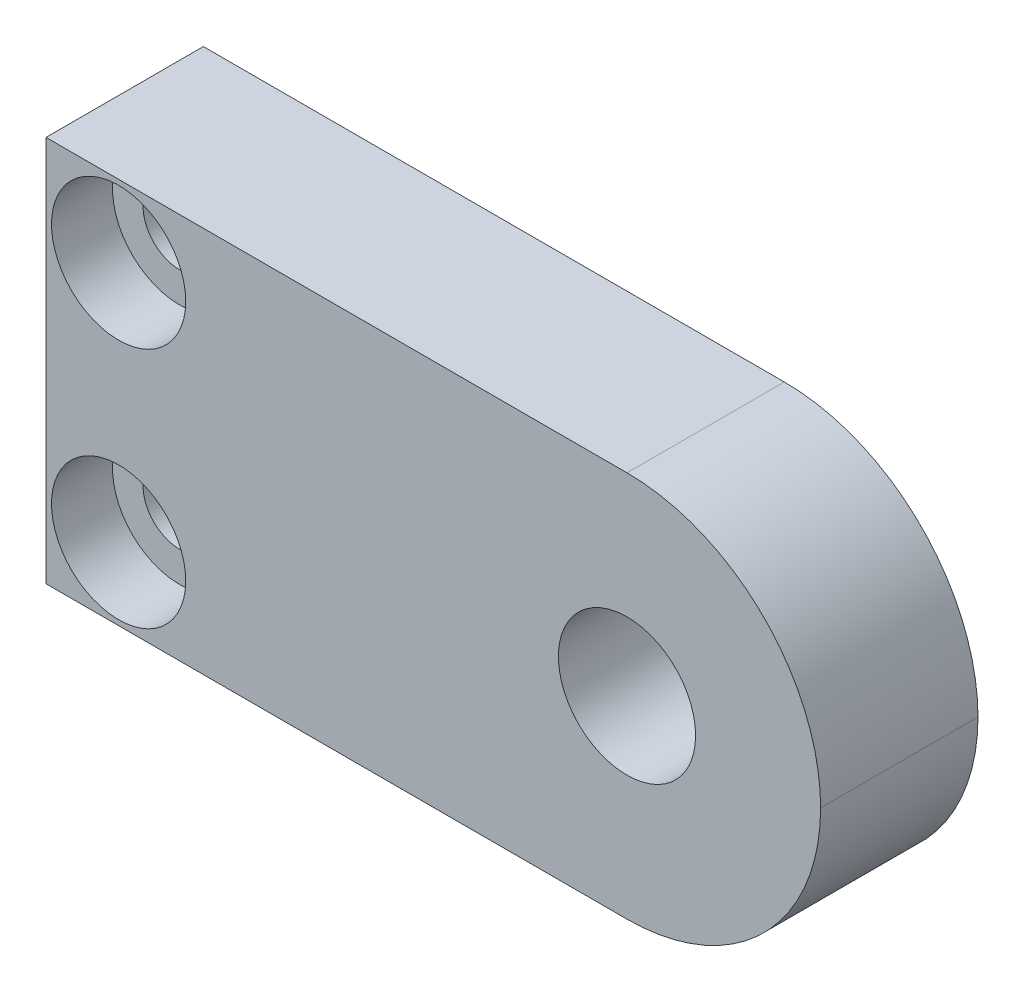
ISO-10303-21;
HEADER;
FILE_DESCRIPTION(('STEP AP214'),'2;1');
FILE_NAME('part.step','',(''),(''),'','','');
FILE_SCHEMA(('AUTOMOTIVE_DESIGN { 1 0 10303 214 1 1 1 1 }'));
ENDSEC;
DATA;
#1=APPLICATION_CONTEXT('core data for automotive mechanical design processes');
#2=APPLICATION_PROTOCOL_DEFINITION('international standard','automotive_design',2000,#1);
#3=PRODUCT_CONTEXT('',#1,'mechanical');
#4=PRODUCT('Part','Part','',(#3));
#5=PRODUCT_RELATED_PRODUCT_CATEGORY('part','',(#4));
#6=PRODUCT_DEFINITION_FORMATION('','',#4);
#7=PRODUCT_DEFINITION_CONTEXT('part definition',#1,'design');
#8=PRODUCT_DEFINITION('design','',#6,#7);
#9=PRODUCT_DEFINITION_SHAPE('','',#8);
#10=(LENGTH_UNIT() NAMED_UNIT(*) SI_UNIT(.MILLI.,.METRE.));
#11=(NAMED_UNIT(*) PLANE_ANGLE_UNIT() SI_UNIT($,.RADIAN.));
#12=(NAMED_UNIT(*) SI_UNIT($,.STERADIAN.) SOLID_ANGLE_UNIT());
#13=UNCERTAINTY_MEASURE_WITH_UNIT(LENGTH_MEASURE(1.E-05),#10,'distance_accuracy_value','');
#14=(GEOMETRIC_REPRESENTATION_CONTEXT(3) GLOBAL_UNCERTAINTY_ASSIGNED_CONTEXT((#13)) GLOBAL_UNIT_ASSIGNED_CONTEXT((#10,
#11,#12)) REPRESENTATION_CONTEXT('',''));
#15=CARTESIAN_POINT('',(0.,0.,0.));
#16=DIRECTION('',(0.,0.,1.));
#17=DIRECTION('',(1.,0.,0.));
#18=AXIS2_PLACEMENT_3D('',#15,#16,#17);
#19=CARTESIAN_POINT('',(0.,6.3373,5.159375));
#20=DIRECTION('',(1.,0.,0.));
#21=DIRECTION('',(0.,0.,-1.));
#22=AXIS2_PLACEMENT_3D('',#19,#20,#21);
#23=PLANE('',#22);
#24=DIRECTION('',(0.,-1.,0.));
#25=VECTOR('',#24,1.);
#26=CARTESIAN_POINT('',(0.,6.3373,0.));
#27=LINE('',#26,#25);
#28=CARTESIAN_POINT('',(0.,6.3373,0.));
#29=VERTEX_POINT('',#28);
#30=CARTESIAN_POINT('',(0.,-6.3373,0.));
#31=VERTEX_POINT('',#30);
#32=EDGE_CURVE('E105',#29,#31,#27,.T.);
#33=ORIENTED_EDGE('',*,*,#32,.T.);
#34=DIRECTION('',(0.,0.,-1.));
#35=VECTOR('',#34,1.);
#36=CARTESIAN_POINT('',(0.,-6.3373,5.159375));
#37=LINE('',#36,#35);
#38=CARTESIAN_POINT('',(0.,-6.3373,5.159375));
#39=VERTEX_POINT('',#38);
#40=EDGE_CURVE('E88',#39,#31,#37,.T.);
#41=ORIENTED_EDGE('',*,*,#40,.F.);
#42=DIRECTION('',(0.,-1.,0.));
#43=VECTOR('',#42,1.);
#44=CARTESIAN_POINT('',(0.,6.3373,5.159375));
#45=LINE('',#44,#43);
#46=CARTESIAN_POINT('',(0.,6.3373,5.159375));
#47=VERTEX_POINT('',#46);
#48=EDGE_CURVE('E94',#47,#39,#45,.T.);
#49=ORIENTED_EDGE('',*,*,#48,.F.);
#50=DIRECTION('',(0.,0.,-1.));
#51=VECTOR('',#50,1.);
#52=CARTESIAN_POINT('',(0.,6.3373,5.159375));
#53=LINE('',#52,#51);
#54=EDGE_CURVE('E108',#47,#29,#53,.T.);
#55=ORIENTED_EDGE('',*,*,#54,.T.);
#56=EDGE_LOOP('',(#33,#41,#49,#55));
#57=FACE_BOUND('',#56,.T.);
#58=ADVANCED_FACE('F38',(#57),#23,.F.);
#59=CARTESIAN_POINT('',(0.,-6.3373,5.159375));
#60=DIRECTION('',(0.,1.,0.));
#61=DIRECTION('',(0.,0.,1.));
#62=AXIS2_PLACEMENT_3D('',#59,#60,#61);
#63=PLANE('',#62);
#64=DIRECTION('',(1.,0.,0.));
#65=VECTOR('',#64,1.);
#66=CARTESIAN_POINT('',(0.,-6.3373,0.));
#67=LINE('',#66,#65);
#68=CARTESIAN_POINT('',(19.05,-6.3373,0.));
#69=VERTEX_POINT('',#68);
#70=EDGE_CURVE('E134',#31,#69,#67,.T.);
#71=ORIENTED_EDGE('',*,*,#70,.T.);
#72=DIRECTION('',(0.,0.,-1.));
#73=VECTOR('',#72,1.);
#74=CARTESIAN_POINT('',(19.05,-6.3373,5.15937499999997));
#75=LINE('',#74,#73);
#76=CARTESIAN_POINT('',(19.05,-6.3373,5.15937499999997));
#77=VERTEX_POINT('',#76);
#78=EDGE_CURVE('E91',#69,#77,#75,.F.);
#79=ORIENTED_EDGE('',*,*,#78,.T.);
#80=DIRECTION('',(1.,0.,0.));
#81=VECTOR('',#80,1.);
#82=CARTESIAN_POINT('',(0.,-6.3373,5.159375));
#83=LINE('',#82,#81);
#84=EDGE_CURVE('E83',#39,#77,#83,.T.);
#85=ORIENTED_EDGE('',*,*,#84,.F.);
#86=ORIENTED_EDGE('',*,*,#40,.T.);
#87=EDGE_LOOP('',(#71,#79,#85,#86));
#88=FACE_BOUND('',#87,.T.);
#89=ADVANCED_FACE('F86',(#88),#63,.F.);
#90=CARTESIAN_POINT('',(0.,6.3373,5.159375));
#91=DIRECTION('',(0.,-1.,0.));
#92=DIRECTION('',(0.,0.,-1.));
#93=AXIS2_PLACEMENT_3D('',#90,#91,#92);
#94=PLANE('',#93);
#95=DIRECTION('',(-1.,0.,0.));
#96=VECTOR('',#95,1.);
#97=CARTESIAN_POINT('',(0.,6.3373,5.159375));
#98=LINE('',#97,#96);
#99=CARTESIAN_POINT('',(19.05,6.3373,5.15937499999997));
#100=VERTEX_POINT('',#99);
#101=EDGE_CURVE('E93',#100,#47,#98,.T.);
#102=ORIENTED_EDGE('',*,*,#101,.F.);
#103=DIRECTION('',(0.,0.,-1.));
#104=VECTOR('',#103,1.);
#105=CARTESIAN_POINT('',(19.05,6.3373,5.15937499999997));
#106=LINE('',#105,#104);
#107=CARTESIAN_POINT('',(19.05,6.3373,0.));
#108=VERTEX_POINT('',#107);
#109=EDGE_CURVE('E11',#100,#108,#106,.T.);
#110=ORIENTED_EDGE('',*,*,#109,.T.);
#111=DIRECTION('',(-1.,0.,0.));
#112=VECTOR('',#111,1.);
#113=CARTESIAN_POINT('',(0.,6.3373,0.));
#114=LINE('',#113,#112);
#115=EDGE_CURVE('E102',#108,#29,#114,.T.);
#116=ORIENTED_EDGE('',*,*,#115,.T.);
#117=ORIENTED_EDGE('',*,*,#54,.F.);
#118=EDGE_LOOP('',(#102,#110,#116,#117));
#119=FACE_BOUND('',#118,.T.);
#120=ADVANCED_FACE('F174',(#119),#94,.F.);
#121=CARTESIAN_POINT('',(0.,0.,5.159375));
#122=DIRECTION('',(0.,0.,1.));
#123=DIRECTION('',(1.,0.,0.));
#124=AXIS2_PLACEMENT_3D('',#121,#122,#123);
#125=PLANE('',#124);
#126=CARTESIAN_POINT('',(2.38125000000006,3.96875,5.159375));
#127=DIRECTION('',(0.,0.,1.));
#128=DIRECTION('',(1.,0.,0.));
#129=AXIS2_PLACEMENT_3D('',#126,#127,#128);
#130=CIRCLE('',#129,2.2);
#131=CARTESIAN_POINT('',(4.58125000000006,3.96875,5.159375));
#132=VERTEX_POINT('',#131);
#133=EDGE_CURVE('E230',#132,#132,#130,.T.);
#134=ORIENTED_EDGE('',*,*,#133,.F.);
#135=EDGE_LOOP('',(#134));
#136=FACE_BOUND('',#135,.T.);
#137=CARTESIAN_POINT('',(2.38125000000006,-3.96875,5.159375));
#138=DIRECTION('',(0.,0.,1.));
#139=DIRECTION('',(1.,0.,0.));
#140=AXIS2_PLACEMENT_3D('',#137,#138,#139);
#141=CIRCLE('',#140,2.2);
#142=CARTESIAN_POINT('',(4.58125000000006,-3.96875,5.159375));
#143=VERTEX_POINT('',#142);
#144=EDGE_CURVE('E245',#143,#143,#141,.T.);
#145=ORIENTED_EDGE('',*,*,#144,.F.);
#146=EDGE_LOOP('',(#145));
#147=FACE_BOUND('',#146,.T.);
#148=CARTESIAN_POINT('',(19.05,0.,5.15937499999997));
#149=DIRECTION('',(0.,0.,1.));
#150=DIRECTION('',(1.,0.,0.));
#151=AXIS2_PLACEMENT_3D('',#148,#149,#150);
#152=CIRCLE('',#151,2.24917);
#153=CARTESIAN_POINT('',(21.29917,0.,5.15937499999997));
#154=VERTEX_POINT('',#153);
#155=EDGE_CURVE('E145',#154,#154,#152,.T.);
#156=ORIENTED_EDGE('',*,*,#155,.F.);
#157=EDGE_LOOP('',(#156));
#158=FACE_BOUND('',#157,.T.);
#159=ORIENTED_EDGE('',*,*,#84,.T.);
#160=CARTESIAN_POINT('',(19.05,0.0126999999999974,5.15937499999997));
#161=DIRECTION('',(0.,0.,1.));
#162=DIRECTION('',(1.,0.,0.));
#163=AXIS2_PLACEMENT_3D('',#160,#161,#162);
#164=CIRCLE('',#163,6.35);
#165=CARTESIAN_POINT('',(25.3999872999872,0.,5.159375));
#166=VERTEX_POINT('',#165);
#167=EDGE_CURVE('E48',#77,#166,#164,.T.);
#168=ORIENTED_EDGE('',*,*,#167,.T.);
#169=CARTESIAN_POINT('',(19.05,-0.0126999999999974,5.15937499999997));
#170=DIRECTION('',(0.,0.,1.));
#171=DIRECTION('',(1.,0.,0.));
#172=AXIS2_PLACEMENT_3D('',#169,#170,#171);
#173=CIRCLE('',#172,6.35);
#174=EDGE_CURVE('E58',#166,#100,#173,.T.);
#175=ORIENTED_EDGE('',*,*,#174,.T.);
#176=ORIENTED_EDGE('',*,*,#101,.T.);
#177=ORIENTED_EDGE('',*,*,#48,.T.);
#178=EDGE_LOOP('',(#159,#168,#175,#176,#177));
#179=FACE_BOUND('',#178,.T.);
#180=ADVANCED_FACE('F97',(#136,#147,#158,#179),#125,.T.);
#181=CARTESIAN_POINT('',(0.,0.,0.));
#182=DIRECTION('',(0.,0.,1.));
#183=DIRECTION('',(1.,0.,0.));
#184=AXIS2_PLACEMENT_3D('',#181,#182,#183);
#185=PLANE('',#184);
#186=CARTESIAN_POINT('',(2.38125,3.96875,0.));
#187=DIRECTION('',(0.,0.,1.));
#188=DIRECTION('',(1.,0.,0.));
#189=AXIS2_PLACEMENT_3D('',#186,#187,#188);
#190=CIRCLE('',#189,1.2);
#191=CARTESIAN_POINT('',(3.58125,3.96875,0.));
#192=VERTEX_POINT('',#191);
#193=EDGE_CURVE('E241',#192,#192,#190,.T.);
#194=ORIENTED_EDGE('',*,*,#193,.T.);
#195=EDGE_LOOP('',(#194));
#196=FACE_BOUND('',#195,.T.);
#197=CARTESIAN_POINT('',(2.38125,-3.96875,0.));
#198=DIRECTION('',(0.,0.,1.));
#199=DIRECTION('',(1.,0.,0.));
#200=AXIS2_PLACEMENT_3D('',#197,#198,#199);
#201=CIRCLE('',#200,1.2);
#202=CARTESIAN_POINT('',(3.58125,-3.96875,0.));
#203=VERTEX_POINT('',#202);
#204=EDGE_CURVE('E146',#203,#203,#201,.T.);
#205=ORIENTED_EDGE('',*,*,#204,.T.);
#206=EDGE_LOOP('',(#205));
#207=FACE_BOUND('',#206,.T.);
#208=CARTESIAN_POINT('',(19.05,0.,0.));
#209=DIRECTION('',(0.,0.,1.));
#210=DIRECTION('',(1.,0.,0.));
#211=AXIS2_PLACEMENT_3D('',#208,#209,#210);
#212=CIRCLE('',#211,2.24917);
#213=CARTESIAN_POINT('',(21.29917,0.,0.));
#214=VERTEX_POINT('',#213);
#215=EDGE_CURVE('E151',#214,#214,#212,.T.);
#216=ORIENTED_EDGE('',*,*,#215,.T.);
#217=EDGE_LOOP('',(#216));
#218=FACE_BOUND('',#217,.T.);
#219=CARTESIAN_POINT('',(19.05,-0.0126999999999974,0.));
#220=DIRECTION('',(0.,0.,1.));
#221=DIRECTION('',(1.,0.,0.));
#222=AXIS2_PLACEMENT_3D('',#219,#220,#221);
#223=CIRCLE('',#222,6.35);
#224=CARTESIAN_POINT('',(25.3999872999873,0.,0.));
#225=VERTEX_POINT('',#224);
#226=EDGE_CURVE('E107',#108,#225,#223,.F.);
#227=ORIENTED_EDGE('',*,*,#226,.T.);
#228=CARTESIAN_POINT('',(19.05,0.0126999999999974,0.));
#229=DIRECTION('',(0.,0.,1.));
#230=DIRECTION('',(1.,0.,0.));
#231=AXIS2_PLACEMENT_3D('',#228,#229,#230);
#232=CIRCLE('',#231,6.35);
#233=EDGE_CURVE('E113',#225,#69,#232,.F.);
#234=ORIENTED_EDGE('',*,*,#233,.T.);
#235=ORIENTED_EDGE('',*,*,#70,.F.);
#236=ORIENTED_EDGE('',*,*,#32,.F.);
#237=ORIENTED_EDGE('',*,*,#115,.F.);
#238=EDGE_LOOP('',(#227,#234,#235,#236,#237));
#239=FACE_BOUND('',#238,.T.);
#240=ADVANCED_FACE('F133',(#196,#207,#218,#239),#185,.F.);
#241=CARTESIAN_POINT('',(19.05,0.,0.));
#242=DIRECTION('',(0.,0.,1.));
#243=DIRECTION('',(1.,0.,0.));
#244=AXIS2_PLACEMENT_3D('',#241,#242,#243);
#245=CYLINDRICAL_SURFACE('',#244,2.24917);
#246=ORIENTED_EDGE('',*,*,#215,.F.);
#247=EDGE_LOOP('',(#246));
#248=FACE_BOUND('',#247,.T.);
#249=ORIENTED_EDGE('',*,*,#155,.T.);
#250=EDGE_LOOP('',(#249));
#251=FACE_BOUND('',#250,.T.);
#252=ADVANCED_FACE('F177',(#248,#251),#245,.F.);
#253=CARTESIAN_POINT('',(19.05,-0.0126999999999974,5.15937499999997));
#254=DIRECTION('',(0.,0.,-1.));
#255=DIRECTION('',(-1.,0.,0.));
#256=AXIS2_PLACEMENT_3D('',#253,#254,#255);
#257=CYLINDRICAL_SURFACE('',#256,6.35);
#258=ORIENTED_EDGE('',*,*,#109,.F.);
#259=ORIENTED_EDGE('',*,*,#174,.F.);
#260=DIRECTION('',(0.,0.,-1.));
#261=VECTOR('',#260,1.);
#262=CARTESIAN_POINT('',(25.3999872999874,0.,2.5796875));
#263=LINE('',#262,#261);
#264=EDGE_CURVE('E42',#225,#166,#263,.F.);
#265=ORIENTED_EDGE('',*,*,#264,.F.);
#266=ORIENTED_EDGE('',*,*,#226,.F.);
#267=EDGE_LOOP('',(#258,#259,#265,#266));
#268=FACE_BOUND('',#267,.T.);
#269=ADVANCED_FACE('F40',(#268),#257,.T.);
#270=CARTESIAN_POINT('',(19.05,0.0126999999999974,5.15937499999997));
#271=DIRECTION('',(0.,0.,-1.));
#272=DIRECTION('',(-1.,0.,0.));
#273=AXIS2_PLACEMENT_3D('',#270,#271,#272);
#274=CYLINDRICAL_SURFACE('',#273,6.35);
#275=ORIENTED_EDGE('',*,*,#167,.F.);
#276=ORIENTED_EDGE('',*,*,#78,.F.);
#277=ORIENTED_EDGE('',*,*,#233,.F.);
#278=ORIENTED_EDGE('',*,*,#264,.T.);
#279=EDGE_LOOP('',(#275,#276,#277,#278));
#280=FACE_BOUND('',#279,.T.);
#281=ADVANCED_FACE('F142',(#280),#274,.T.);
#282=CARTESIAN_POINT('',(2.38125000000006,-3.96875,5.159375));
#283=DIRECTION('',(0.,0.,1.));
#284=DIRECTION('',(1.,0.,0.));
#285=AXIS2_PLACEMENT_3D('',#282,#283,#284);
#286=CYLINDRICAL_SURFACE('',#285,1.2);
#287=ORIENTED_EDGE('',*,*,#204,.F.);
#288=EDGE_LOOP('',(#287));
#289=FACE_BOUND('',#288,.T.);
#290=CARTESIAN_POINT('',(2.38125,-3.96875,3.159375));
#291=DIRECTION('',(0.,0.,1.));
#292=DIRECTION('',(1.,0.,0.));
#293=AXIS2_PLACEMENT_3D('',#290,#291,#292);
#294=CIRCLE('',#293,1.2);
#295=CARTESIAN_POINT('',(3.58125,-3.96875,3.159375));
#296=VERTEX_POINT('',#295);
#297=EDGE_CURVE('E154',#296,#296,#294,.T.);
#298=ORIENTED_EDGE('',*,*,#297,.T.);
#299=EDGE_LOOP('',(#298));
#300=FACE_BOUND('',#299,.T.);
#301=ADVANCED_FACE('F182',(#289,#300),#286,.F.);
#302=CARTESIAN_POINT('',(3.58125000000001,-3.96875,3.15937499999997));
#303=DIRECTION('',(0.,0.,-1.));
#304=DIRECTION('',(-1.,0.,0.));
#305=AXIS2_PLACEMENT_3D('',#302,#303,#304);
#306=PLANE('',#305);
#307=ORIENTED_EDGE('',*,*,#297,.F.);
#308=EDGE_LOOP('',(#307));
#309=FACE_BOUND('',#308,.T.);
#310=CARTESIAN_POINT('',(2.38125,-3.96875,3.159375));
#311=DIRECTION('',(0.,0.,1.));
#312=DIRECTION('',(1.,0.,0.));
#313=AXIS2_PLACEMENT_3D('',#310,#311,#312);
#314=CIRCLE('',#313,2.2);
#315=CARTESIAN_POINT('',(4.58125,-3.96875,3.159375));
#316=VERTEX_POINT('',#315);
#317=EDGE_CURVE('E161',#316,#316,#314,.T.);
#318=ORIENTED_EDGE('',*,*,#317,.T.);
#319=EDGE_LOOP('',(#318));
#320=FACE_BOUND('',#319,.T.);
#321=ADVANCED_FACE('F202',(#309,#320),#306,.F.);
#322=CARTESIAN_POINT('',(2.38125000000006,-3.96875,5.159375));
#323=DIRECTION('',(0.,0.,1.));
#324=DIRECTION('',(1.,0.,0.));
#325=AXIS2_PLACEMENT_3D('',#322,#323,#324);
#326=CYLINDRICAL_SURFACE('',#325,2.2);
#327=ORIENTED_EDGE('',*,*,#317,.F.);
#328=EDGE_LOOP('',(#327));
#329=FACE_BOUND('',#328,.T.);
#330=ORIENTED_EDGE('',*,*,#144,.T.);
#331=EDGE_LOOP('',(#330));
#332=FACE_BOUND('',#331,.T.);
#333=ADVANCED_FACE('F206',(#329,#332),#326,.F.);
#334=CARTESIAN_POINT('',(2.38125000000006,3.96875,5.159375));
#335=DIRECTION('',(0.,0.,1.));
#336=DIRECTION('',(1.,0.,0.));
#337=AXIS2_PLACEMENT_3D('',#334,#335,#336);
#338=CYLINDRICAL_SURFACE('',#337,1.2);
#339=ORIENTED_EDGE('',*,*,#193,.F.);
#340=EDGE_LOOP('',(#339));
#341=FACE_BOUND('',#340,.T.);
#342=CARTESIAN_POINT('',(2.38125,3.96875,3.159375));
#343=DIRECTION('',(0.,0.,1.));
#344=DIRECTION('',(1.,0.,0.));
#345=AXIS2_PLACEMENT_3D('',#342,#343,#344);
#346=CIRCLE('',#345,1.2);
#347=CARTESIAN_POINT('',(3.58125,3.96875,3.159375));
#348=VERTEX_POINT('',#347);
#349=EDGE_CURVE('E235',#348,#348,#346,.T.);
#350=ORIENTED_EDGE('',*,*,#349,.T.);
#351=EDGE_LOOP('',(#350));
#352=FACE_BOUND('',#351,.T.);
#353=ADVANCED_FACE('F210',(#341,#352),#338,.F.);
#354=CARTESIAN_POINT('',(3.58125000000001,3.96875,3.15937499999997));
#355=DIRECTION('',(0.,0.,-1.));
#356=DIRECTION('',(-1.,0.,0.));
#357=AXIS2_PLACEMENT_3D('',#354,#355,#356);
#358=PLANE('',#357);
#359=ORIENTED_EDGE('',*,*,#349,.F.);
#360=EDGE_LOOP('',(#359));
#361=FACE_BOUND('',#360,.T.);
#362=CARTESIAN_POINT('',(2.38125,3.96875,3.159375));
#363=DIRECTION('',(0.,0.,1.));
#364=DIRECTION('',(1.,0.,0.));
#365=AXIS2_PLACEMENT_3D('',#362,#363,#364);
#366=CIRCLE('',#365,2.2);
#367=CARTESIAN_POINT('',(4.58125,3.96875,3.159375));
#368=VERTEX_POINT('',#367);
#369=EDGE_CURVE('E227',#368,#368,#366,.T.);
#370=ORIENTED_EDGE('',*,*,#369,.T.);
#371=EDGE_LOOP('',(#370));
#372=FACE_BOUND('',#371,.T.);
#373=ADVANCED_FACE('F214',(#361,#372),#358,.F.);
#374=CARTESIAN_POINT('',(2.38125000000006,3.96875,5.159375));
#375=DIRECTION('',(0.,0.,1.));
#376=DIRECTION('',(1.,0.,0.));
#377=AXIS2_PLACEMENT_3D('',#374,#375,#376);
#378=CYLINDRICAL_SURFACE('',#377,2.2);
#379=ORIENTED_EDGE('',*,*,#369,.F.);
#380=EDGE_LOOP('',(#379));
#381=FACE_BOUND('',#380,.T.);
#382=ORIENTED_EDGE('',*,*,#133,.T.);
#383=EDGE_LOOP('',(#382));
#384=FACE_BOUND('',#383,.T.);
#385=ADVANCED_FACE('F218',(#381,#384),#378,.F.);
#386=CLOSED_SHELL('',(#58,#89,#120,#180,#240,#252,#269,#281,#301,#321,#333,#353,#373,#385));
#387=MANIFOLD_SOLID_BREP('B2',#386);
#388=ADVANCED_BREP_SHAPE_REPRESENTATION('',(#18,#387),#14);
#389=SHAPE_DEFINITION_REPRESENTATION(#9,#388);
ENDSEC;
END-ISO-10303-21;
